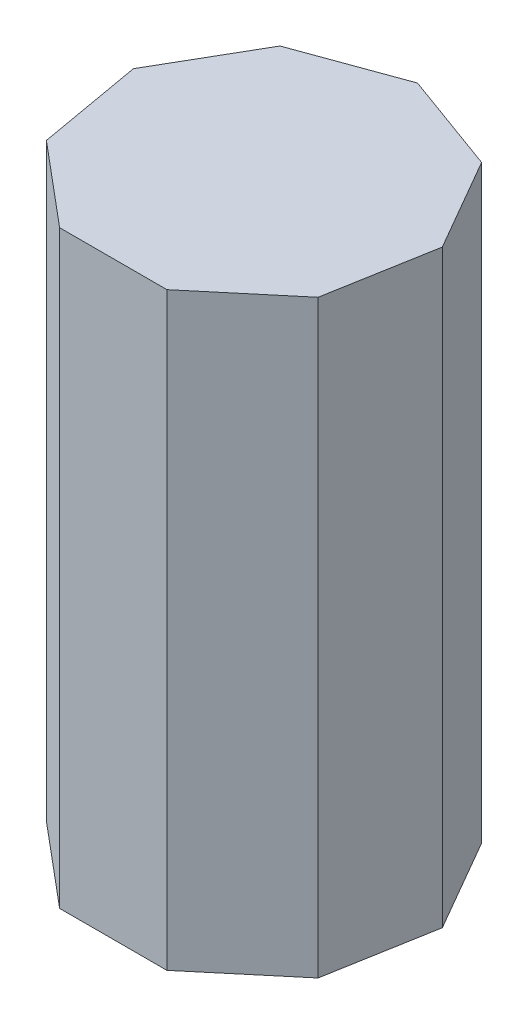
ISO-10303-21;
HEADER;
FILE_DESCRIPTION(('STEP AP214'),'2;1');
FILE_NAME('part.step','',(''),(''),'','','');
FILE_SCHEMA(('AUTOMOTIVE_DESIGN { 1 0 10303 214 1 1 1 1 }'));
ENDSEC;
DATA;
#1=APPLICATION_CONTEXT('core data for automotive mechanical design processes');
#2=APPLICATION_PROTOCOL_DEFINITION('international standard','automotive_design',2000,#1);
#3=PRODUCT_CONTEXT('',#1,'mechanical');
#4=PRODUCT('Part','Part','',(#3));
#5=PRODUCT_RELATED_PRODUCT_CATEGORY('part','',(#4));
#6=PRODUCT_DEFINITION_FORMATION('','',#4);
#7=PRODUCT_DEFINITION_CONTEXT('part definition',#1,'design');
#8=PRODUCT_DEFINITION('design','',#6,#7);
#9=PRODUCT_DEFINITION_SHAPE('','',#8);
#10=(LENGTH_UNIT() NAMED_UNIT(*) SI_UNIT(.MILLI.,.METRE.));
#11=(NAMED_UNIT(*) PLANE_ANGLE_UNIT() SI_UNIT($,.RADIAN.));
#12=(NAMED_UNIT(*) SI_UNIT($,.STERADIAN.) SOLID_ANGLE_UNIT());
#13=UNCERTAINTY_MEASURE_WITH_UNIT(LENGTH_MEASURE(1.E-05),#10,'distance_accuracy_value','');
#14=(GEOMETRIC_REPRESENTATION_CONTEXT(3) GLOBAL_UNCERTAINTY_ASSIGNED_CONTEXT((#13)) GLOBAL_UNIT_ASSIGNED_CONTEXT((#10,
#11,#12)) REPRESENTATION_CONTEXT('',''));
#15=CARTESIAN_POINT('',(0.,0.,0.));
#16=DIRECTION('',(0.,0.,1.));
#17=DIRECTION('',(1.,0.,0.));
#18=AXIS2_PLACEMENT_3D('',#15,#16,#17);
#19=CARTESIAN_POINT('',(4.60802492553438,20.,2.66044443118977));
#20=DIRECTION('',(-0.984807753012208,0.,-0.17364817766693));
#21=DIRECTION('',(-0.17364817766693,0.,0.984807753012208));
#22=AXIS2_PLACEMENT_3D('',#19,#20,#21);
#23=PLANE('',#22);
#24=DIRECTION('',(0.17364817766693,0.,-0.984807753012208));
#25=VECTOR('',#24,1.);
#26=CARTESIAN_POINT('',(4.60802492553438,0.,2.66044443118977));
#27=LINE('',#26,#25);
#28=CARTESIAN_POINT('',(4.60802492553438,0.,2.66044443118977));
#29=VERTEX_POINT('',#28);
#30=CARTESIAN_POINT('',(5.2400526045877,0.,-0.923962654520479));
#31=VERTEX_POINT('',#30);
#32=EDGE_CURVE('E104',#29,#31,#27,.T.);
#33=ORIENTED_EDGE('',*,*,#32,.T.);
#34=DIRECTION('',(0.,-1.,0.));
#35=VECTOR('',#34,1.);
#36=CARTESIAN_POINT('',(5.2400526045877,20.,-0.923962654520479));
#37=LINE('',#36,#35);
#38=CARTESIAN_POINT('',(5.2400526045877,20.,-0.923962654520479));
#39=VERTEX_POINT('',#38);
#40=EDGE_CURVE('E11',#39,#31,#37,.T.);
#41=ORIENTED_EDGE('',*,*,#40,.F.);
#42=DIRECTION('',(0.17364817766693,0.,-0.984807753012208));
#43=VECTOR('',#42,1.);
#44=CARTESIAN_POINT('',(4.60802492553438,20.,2.66044443118977));
#45=LINE('',#44,#43);
#46=CARTESIAN_POINT('',(4.60802492553438,20.,2.66044443118977));
#47=VERTEX_POINT('',#46);
#48=EDGE_CURVE('E133',#47,#39,#45,.T.);
#49=ORIENTED_EDGE('',*,*,#48,.F.);
#50=DIRECTION('',(0.,-1.,0.));
#51=VECTOR('',#50,1.);
#52=CARTESIAN_POINT('',(4.60802492553438,20.,2.66044443118977));
#53=LINE('',#52,#51);
#54=EDGE_CURVE('E117',#47,#29,#53,.T.);
#55=ORIENTED_EDGE('',*,*,#54,.T.);
#56=EDGE_LOOP('',(#33,#41,#49,#55));
#57=FACE_BOUND('',#56,.T.);
#58=ADVANCED_FACE('F30',(#57),#23,.F.);
#59=CARTESIAN_POINT('',(5.2400526045877,20.,-0.923962654520479));
#60=DIRECTION('',(-0.866025403784438,0.,0.500000000000001));
#61=DIRECTION('',(0.500000000000001,0.,0.866025403784438));
#62=AXIS2_PLACEMENT_3D('',#59,#60,#61);
#63=PLANE('',#62);
#64=DIRECTION('',(-0.500000000000001,0.,-0.866025403784438));
#65=VECTOR('',#64,1.);
#66=CARTESIAN_POINT('',(5.2400526045877,0.,-0.923962654520479));
#67=LINE('',#66,#65);
#68=CARTESIAN_POINT('',(3.4202014332567,0.,-4.0760373454795));
#69=VERTEX_POINT('',#68);
#70=EDGE_CURVE('E100',#31,#69,#67,.T.);
#71=ORIENTED_EDGE('',*,*,#70,.T.);
#72=DIRECTION('',(0.,-1.,0.));
#73=VECTOR('',#72,1.);
#74=CARTESIAN_POINT('',(3.4202014332567,20.,-4.0760373454795));
#75=LINE('',#74,#73);
#76=CARTESIAN_POINT('',(3.4202014332567,20.,-4.0760373454795));
#77=VERTEX_POINT('',#76);
#78=EDGE_CURVE('E37',#77,#69,#75,.T.);
#79=ORIENTED_EDGE('',*,*,#78,.F.);
#80=DIRECTION('',(-0.500000000000001,0.,-0.866025403784438));
#81=VECTOR('',#80,1.);
#82=CARTESIAN_POINT('',(5.2400526045877,20.,-0.923962654520479));
#83=LINE('',#82,#81);
#84=EDGE_CURVE('E113',#39,#77,#83,.T.);
#85=ORIENTED_EDGE('',*,*,#84,.F.);
#86=ORIENTED_EDGE('',*,*,#40,.T.);
#87=EDGE_LOOP('',(#71,#79,#85,#86));
#88=FACE_BOUND('',#87,.T.);
#89=ADVANCED_FACE('F112',(#88),#63,.F.);
#90=CARTESIAN_POINT('',(3.4202014332567,20.,-4.0760373454795));
#91=DIRECTION('',(-0.342020143325669,0.,0.939692620785908));
#92=DIRECTION('',(0.939692620785908,0.,0.342020143325669));
#93=AXIS2_PLACEMENT_3D('',#90,#91,#92);
#94=PLANE('',#93);
#95=DIRECTION('',(-0.939692620785908,0.,-0.342020143325669));
#96=VECTOR('',#95,1.);
#97=CARTESIAN_POINT('',(3.4202014332567,0.,-4.0760373454795));
#98=LINE('',#97,#96);
#99=CARTESIAN_POINT('',(0.,0.,-5.32088886237955));
#100=VERTEX_POINT('',#99);
#101=EDGE_CURVE('E106',#69,#100,#98,.T.);
#102=ORIENTED_EDGE('',*,*,#101,.T.);
#103=DIRECTION('',(0.,-1.,0.));
#104=VECTOR('',#103,1.);
#105=CARTESIAN_POINT('',(0.,20.,-5.32088886237955));
#106=LINE('',#105,#104);
#107=CARTESIAN_POINT('',(0.,20.,-5.32088886237955));
#108=VERTEX_POINT('',#107);
#109=EDGE_CURVE('E164',#108,#100,#106,.T.);
#110=ORIENTED_EDGE('',*,*,#109,.F.);
#111=DIRECTION('',(-0.939692620785908,0.,-0.342020143325669));
#112=VECTOR('',#111,1.);
#113=CARTESIAN_POINT('',(3.4202014332567,20.,-4.0760373454795));
#114=LINE('',#113,#112);
#115=EDGE_CURVE('E136',#77,#108,#114,.T.);
#116=ORIENTED_EDGE('',*,*,#115,.F.);
#117=ORIENTED_EDGE('',*,*,#78,.T.);
#118=EDGE_LOOP('',(#102,#110,#116,#117));
#119=FACE_BOUND('',#118,.T.);
#120=ADVANCED_FACE('F168',(#119),#94,.F.);
#121=CARTESIAN_POINT('',(0.,20.,-5.32088886237955));
#122=DIRECTION('',(0.342020143325668,0.,0.939692620785909));
#123=DIRECTION('',(0.939692620785909,0.,-0.342020143325668));
#124=AXIS2_PLACEMENT_3D('',#121,#122,#123);
#125=PLANE('',#124);
#126=DIRECTION('',(-0.939692620785909,0.,0.342020143325668));
#127=VECTOR('',#126,1.);
#128=CARTESIAN_POINT('',(0.,0.,-5.32088886237955));
#129=LINE('',#128,#127);
#130=CARTESIAN_POINT('',(-3.42020143325669,0.,-4.07603734547952));
#131=VERTEX_POINT('',#130);
#132=EDGE_CURVE('E121',#100,#131,#129,.T.);
#133=ORIENTED_EDGE('',*,*,#132,.T.);
#134=DIRECTION('',(0.,-1.,0.));
#135=VECTOR('',#134,1.);
#136=CARTESIAN_POINT('',(-3.42020143325669,20.,-4.07603734547952));
#137=LINE('',#136,#135);
#138=CARTESIAN_POINT('',(-3.42020143325669,20.,-4.07603734547952));
#139=VERTEX_POINT('',#138);
#140=EDGE_CURVE('E161',#139,#131,#137,.T.);
#141=ORIENTED_EDGE('',*,*,#140,.F.);
#142=DIRECTION('',(-0.939692620785909,0.,0.342020143325668));
#143=VECTOR('',#142,1.);
#144=CARTESIAN_POINT('',(0.,20.,-5.32088886237955));
#145=LINE('',#144,#143);
#146=EDGE_CURVE('E138',#108,#139,#145,.T.);
#147=ORIENTED_EDGE('',*,*,#146,.F.);
#148=ORIENTED_EDGE('',*,*,#109,.T.);
#149=EDGE_LOOP('',(#133,#141,#147,#148));
#150=FACE_BOUND('',#149,.T.);
#151=ADVANCED_FACE('F176',(#150),#125,.F.);
#152=CARTESIAN_POINT('',(-3.42020143325669,20.,-4.07603734547952));
#153=DIRECTION('',(0.866025403784439,0.,0.5));
#154=DIRECTION('',(0.5,0.,-0.866025403784439));
#155=AXIS2_PLACEMENT_3D('',#152,#153,#154);
#156=PLANE('',#155);
#157=DIRECTION('',(-0.5,0.,0.866025403784439));
#158=VECTOR('',#157,1.);
#159=CARTESIAN_POINT('',(-3.42020143325669,0.,-4.07603734547952));
#160=LINE('',#159,#158);
#161=CARTESIAN_POINT('',(-5.24005260458769,0.,-0.923962654520479));
#162=VERTEX_POINT('',#161);
#163=EDGE_CURVE('E123',#131,#162,#160,.T.);
#164=ORIENTED_EDGE('',*,*,#163,.T.);
#165=DIRECTION('',(0.,-1.,0.));
#166=VECTOR('',#165,1.);
#167=CARTESIAN_POINT('',(-5.24005260458769,20.,-0.923962654520479));
#168=LINE('',#167,#166);
#169=CARTESIAN_POINT('',(-5.24005260458769,20.,-0.923962654520479));
#170=VERTEX_POINT('',#169);
#171=EDGE_CURVE('E158',#170,#162,#168,.T.);
#172=ORIENTED_EDGE('',*,*,#171,.F.);
#173=DIRECTION('',(-0.5,0.,0.866025403784439));
#174=VECTOR('',#173,1.);
#175=CARTESIAN_POINT('',(-3.42020143325669,20.,-4.07603734547952));
#176=LINE('',#175,#174);
#177=EDGE_CURVE('E140',#139,#170,#176,.T.);
#178=ORIENTED_EDGE('',*,*,#177,.F.);
#179=ORIENTED_EDGE('',*,*,#140,.T.);
#180=EDGE_LOOP('',(#164,#172,#178,#179));
#181=FACE_BOUND('',#180,.T.);
#182=ADVANCED_FACE('F179',(#181),#156,.F.);
#183=CARTESIAN_POINT('',(-5.24005260458769,20.,-0.923962654520479));
#184=DIRECTION('',(0.984807753012208,0.,-0.173648177666931));
#185=DIRECTION('',(-0.173648177666931,0.,-0.984807753012208));
#186=AXIS2_PLACEMENT_3D('',#183,#184,#185);
#187=PLANE('',#186);
#188=DIRECTION('',(0.173648177666931,0.,0.984807753012208));
#189=VECTOR('',#188,1.);
#190=CARTESIAN_POINT('',(-5.24005260458769,0.,-0.923962654520479));
#191=LINE('',#190,#189);
#192=CARTESIAN_POINT('',(-4.60802492553437,0.,2.66044443118978));
#193=VERTEX_POINT('',#192);
#194=EDGE_CURVE('E125',#162,#193,#191,.T.);
#195=ORIENTED_EDGE('',*,*,#194,.T.);
#196=DIRECTION('',(0.,-1.,0.));
#197=VECTOR('',#196,1.);
#198=CARTESIAN_POINT('',(-4.60802492553437,20.,2.66044443118978));
#199=LINE('',#198,#197);
#200=CARTESIAN_POINT('',(-4.60802492553437,20.,2.66044443118978));
#201=VERTEX_POINT('',#200);
#202=EDGE_CURVE('E155',#201,#193,#199,.T.);
#203=ORIENTED_EDGE('',*,*,#202,.F.);
#204=DIRECTION('',(0.173648177666931,0.,0.984807753012208));
#205=VECTOR('',#204,1.);
#206=CARTESIAN_POINT('',(-5.24005260458769,20.,-0.923962654520479));
#207=LINE('',#206,#205);
#208=EDGE_CURVE('E142',#170,#201,#207,.T.);
#209=ORIENTED_EDGE('',*,*,#208,.F.);
#210=ORIENTED_EDGE('',*,*,#171,.T.);
#211=EDGE_LOOP('',(#195,#203,#209,#210));
#212=FACE_BOUND('',#211,.T.);
#213=ADVANCED_FACE('F184',(#212),#187,.F.);
#214=CARTESIAN_POINT('',(-4.60802492553437,20.,2.66044443118978));
#215=DIRECTION('',(0.64278760968654,0.,-0.766044443118978));
#216=DIRECTION('',(-0.766044443118978,0.,-0.64278760968654));
#217=AXIS2_PLACEMENT_3D('',#214,#215,#216);
#218=PLANE('',#217);
#219=DIRECTION('',(0.766044443118978,0.,0.64278760968654));
#220=VECTOR('',#219,1.);
#221=CARTESIAN_POINT('',(-4.60802492553437,0.,2.66044443118978));
#222=LINE('',#221,#220);
#223=CARTESIAN_POINT('',(-1.81985117133101,0.,5.));
#224=VERTEX_POINT('',#223);
#225=EDGE_CURVE('E127',#193,#224,#222,.T.);
#226=ORIENTED_EDGE('',*,*,#225,.T.);
#227=DIRECTION('',(0.,-1.,0.));
#228=VECTOR('',#227,1.);
#229=CARTESIAN_POINT('',(-1.81985117133101,20.,5.));
#230=LINE('',#229,#228);
#231=CARTESIAN_POINT('',(-1.81985117133101,20.,5.));
#232=VERTEX_POINT('',#231);
#233=EDGE_CURVE('E152',#232,#224,#230,.T.);
#234=ORIENTED_EDGE('',*,*,#233,.F.);
#235=DIRECTION('',(0.766044443118978,0.,0.64278760968654));
#236=VECTOR('',#235,1.);
#237=CARTESIAN_POINT('',(-4.60802492553437,20.,2.66044443118978));
#238=LINE('',#237,#236);
#239=EDGE_CURVE('E144',#201,#232,#238,.T.);
#240=ORIENTED_EDGE('',*,*,#239,.F.);
#241=ORIENTED_EDGE('',*,*,#202,.T.);
#242=EDGE_LOOP('',(#226,#234,#240,#241));
#243=FACE_BOUND('',#242,.T.);
#244=ADVANCED_FACE('F188',(#243),#218,.F.);
#245=CARTESIAN_POINT('',(-1.81985117133101,20.,5.));
#246=DIRECTION('',(0.,0.,-1.));
#247=DIRECTION('',(-1.,0.,0.));
#248=AXIS2_PLACEMENT_3D('',#245,#246,#247);
#249=PLANE('',#248);
#250=DIRECTION('',(1.,0.,0.));
#251=VECTOR('',#250,1.);
#252=CARTESIAN_POINT('',(-1.81985117133101,0.,5.));
#253=LINE('',#252,#251);
#254=CARTESIAN_POINT('',(1.81985117133101,0.,4.99999999999999));
#255=VERTEX_POINT('',#254);
#256=EDGE_CURVE('E129',#224,#255,#253,.T.);
#257=ORIENTED_EDGE('',*,*,#256,.T.);
#258=DIRECTION('',(0.,-1.,0.));
#259=VECTOR('',#258,1.);
#260=CARTESIAN_POINT('',(1.81985117133101,20.,4.99999999999999));
#261=LINE('',#260,#259);
#262=CARTESIAN_POINT('',(1.81985117133101,20.,4.99999999999999));
#263=VERTEX_POINT('',#262);
#264=EDGE_CURVE('E149',#263,#255,#261,.T.);
#265=ORIENTED_EDGE('',*,*,#264,.F.);
#266=DIRECTION('',(1.,0.,0.));
#267=VECTOR('',#266,1.);
#268=CARTESIAN_POINT('',(-1.81985117133101,20.,5.));
#269=LINE('',#268,#267);
#270=EDGE_CURVE('E49',#232,#263,#269,.T.);
#271=ORIENTED_EDGE('',*,*,#270,.F.);
#272=ORIENTED_EDGE('',*,*,#233,.T.);
#273=EDGE_LOOP('',(#257,#265,#271,#272));
#274=FACE_BOUND('',#273,.T.);
#275=ADVANCED_FACE('F192',(#274),#249,.F.);
#276=CARTESIAN_POINT('',(1.81985117133101,20.,4.99999999999999));
#277=DIRECTION('',(-0.642787609686539,0.,-0.766044443118978));
#278=DIRECTION('',(-0.766044443118978,0.,0.642787609686539));
#279=AXIS2_PLACEMENT_3D('',#276,#277,#278);
#280=PLANE('',#279);
#281=DIRECTION('',(0.766044443118978,0.,-0.642787609686539));
#282=VECTOR('',#281,1.);
#283=CARTESIAN_POINT('',(1.81985117133101,0.,4.99999999999999));
#284=LINE('',#283,#282);
#285=EDGE_CURVE('E131',#255,#29,#284,.T.);
#286=ORIENTED_EDGE('',*,*,#285,.T.);
#287=ORIENTED_EDGE('',*,*,#54,.F.);
#288=DIRECTION('',(0.766044443118978,0.,-0.642787609686539));
#289=VECTOR('',#288,1.);
#290=CARTESIAN_POINT('',(1.81985117133101,20.,4.99999999999999));
#291=LINE('',#290,#289);
#292=EDGE_CURVE('E44',#263,#47,#291,.T.);
#293=ORIENTED_EDGE('',*,*,#292,.F.);
#294=ORIENTED_EDGE('',*,*,#264,.T.);
#295=EDGE_LOOP('',(#286,#287,#293,#294));
#296=FACE_BOUND('',#295,.T.);
#297=ADVANCED_FACE('F194',(#296),#280,.F.);
#298=CARTESIAN_POINT('',(5.65257937423568,20.,-3.26351822333068));
#299=DIRECTION('',(0.,1.,0.));
#300=DIRECTION('',(0.,0.,1.));
#301=AXIS2_PLACEMENT_3D('',#298,#299,#300);
#302=PLANE('',#301);
#303=ORIENTED_EDGE('',*,*,#48,.T.);
#304=ORIENTED_EDGE('',*,*,#84,.T.);
#305=ORIENTED_EDGE('',*,*,#115,.T.);
#306=ORIENTED_EDGE('',*,*,#146,.T.);
#307=ORIENTED_EDGE('',*,*,#177,.T.);
#308=ORIENTED_EDGE('',*,*,#208,.T.);
#309=ORIENTED_EDGE('',*,*,#239,.T.);
#310=ORIENTED_EDGE('',*,*,#270,.T.);
#311=ORIENTED_EDGE('',*,*,#292,.T.);
#312=EDGE_LOOP('',(#303,#304,#305,#306,#307,#308,#309,#310,#311));
#313=FACE_BOUND('',#312,.T.);
#314=ADVANCED_FACE('F171',(#313),#302,.T.);
#315=CARTESIAN_POINT('',(5.65257937423568,0.,-3.26351822333068));
#316=DIRECTION('',(0.,1.,0.));
#317=DIRECTION('',(0.,0.,1.));
#318=AXIS2_PLACEMENT_3D('',#315,#316,#317);
#319=PLANE('',#318);
#320=ORIENTED_EDGE('',*,*,#32,.F.);
#321=ORIENTED_EDGE('',*,*,#285,.F.);
#322=ORIENTED_EDGE('',*,*,#256,.F.);
#323=ORIENTED_EDGE('',*,*,#225,.F.);
#324=ORIENTED_EDGE('',*,*,#194,.F.);
#325=ORIENTED_EDGE('',*,*,#163,.F.);
#326=ORIENTED_EDGE('',*,*,#132,.F.);
#327=ORIENTED_EDGE('',*,*,#101,.F.);
#328=ORIENTED_EDGE('',*,*,#70,.F.);
#329=EDGE_LOOP('',(#320,#321,#322,#323,#324,#325,#326,#327,#328));
#330=FACE_BOUND('',#329,.T.);
#331=ADVANCED_FACE('F101',(#330),#319,.F.);
#332=CLOSED_SHELL('',(#58,#89,#120,#151,#182,#213,#244,#275,#297,#314,#331));
#333=MANIFOLD_SOLID_BREP('B2',#332);
#334=ADVANCED_BREP_SHAPE_REPRESENTATION('',(#18,#333),#14);
#335=SHAPE_DEFINITION_REPRESENTATION(#9,#334);
ENDSEC;
END-ISO-10303-21;
